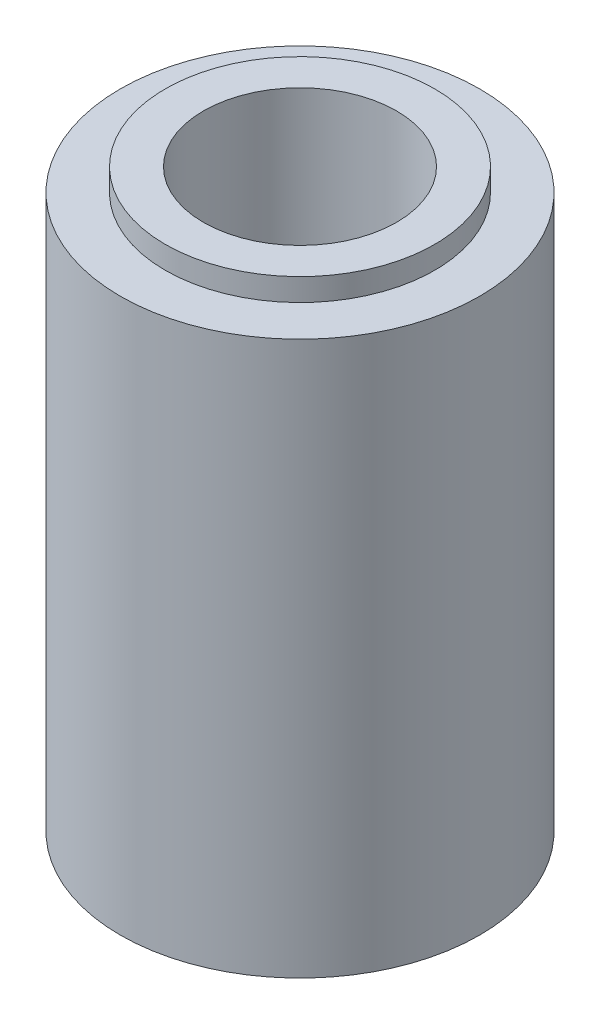
ISO-10303-21;
HEADER;
FILE_DESCRIPTION(('STEP AP214'),'2;1');
FILE_NAME('part.step','',(''),(''),'','','');
FILE_SCHEMA(('AUTOMOTIVE_DESIGN { 1 0 10303 214 1 1 1 1 }'));
ENDSEC;
DATA;
#1=APPLICATION_CONTEXT('core data for automotive mechanical design processes');
#2=APPLICATION_PROTOCOL_DEFINITION('international standard','automotive_design',2000,#1);
#3=PRODUCT_CONTEXT('',#1,'mechanical');
#4=PRODUCT('Part','Part','',(#3));
#5=PRODUCT_RELATED_PRODUCT_CATEGORY('part','',(#4));
#6=PRODUCT_DEFINITION_FORMATION('','',#4);
#7=PRODUCT_DEFINITION_CONTEXT('part definition',#1,'design');
#8=PRODUCT_DEFINITION('design','',#6,#7);
#9=PRODUCT_DEFINITION_SHAPE('','',#8);
#10=(LENGTH_UNIT() NAMED_UNIT(*) SI_UNIT(.MILLI.,.METRE.));
#11=(NAMED_UNIT(*) PLANE_ANGLE_UNIT() SI_UNIT($,.RADIAN.));
#12=(NAMED_UNIT(*) SI_UNIT($,.STERADIAN.) SOLID_ANGLE_UNIT());
#13=UNCERTAINTY_MEASURE_WITH_UNIT(LENGTH_MEASURE(1.E-05),#10,'distance_accuracy_value','');
#14=(GEOMETRIC_REPRESENTATION_CONTEXT(3) GLOBAL_UNCERTAINTY_ASSIGNED_CONTEXT((#13)) GLOBAL_UNIT_ASSIGNED_CONTEXT((#10,
#11,#12)) REPRESENTATION_CONTEXT('',''));
#15=CARTESIAN_POINT('',(0.,0.,0.));
#16=DIRECTION('',(0.,0.,1.));
#17=DIRECTION('',(1.,0.,0.));
#18=AXIS2_PLACEMENT_3D('',#15,#16,#17);
#19=CARTESIAN_POINT('',(0.,12.82,0.));
#20=DIRECTION('',(0.,-1.,0.));
#21=DIRECTION('',(0.,0.,-1.));
#22=AXIS2_PLACEMENT_3D('',#19,#20,#21);
#23=CYLINDRICAL_SURFACE('',#22,4.);
#24=CARTESIAN_POINT('',(0.,0.,0.));
#25=DIRECTION('',(0.,1.,0.));
#26=DIRECTION('',(0.,0.,1.));
#27=AXIS2_PLACEMENT_3D('',#24,#25,#26);
#28=CIRCLE('',#27,4.);
#29=CARTESIAN_POINT('',(0.,0.,4.));
#30=VERTEX_POINT('',#29);
#31=EDGE_CURVE('E11',#30,#30,#28,.T.);
#32=ORIENTED_EDGE('',*,*,#31,.T.);
#33=EDGE_LOOP('',(#32));
#34=FACE_BOUND('',#33,.T.);
#35=CARTESIAN_POINT('',(0.,12.32,0.));
#36=DIRECTION('',(0.,1.,0.));
#37=DIRECTION('',(0.,0.,1.));
#38=AXIS2_PLACEMENT_3D('',#35,#36,#37);
#39=CIRCLE('',#38,4.);
#40=CARTESIAN_POINT('',(0.,12.32,4.));
#41=VERTEX_POINT('',#40);
#42=EDGE_CURVE('E35',#41,#41,#39,.T.);
#43=ORIENTED_EDGE('',*,*,#42,.F.);
#44=EDGE_LOOP('',(#43));
#45=FACE_BOUND('',#44,.T.);
#46=ADVANCED_FACE('F32',(#34,#45),#23,.T.);
#47=CARTESIAN_POINT('',(0.,0.,0.));
#48=DIRECTION('',(0.,1.,0.));
#49=DIRECTION('',(0.,0.,1.));
#50=AXIS2_PLACEMENT_3D('',#47,#48,#49);
#51=PLANE('',#50);
#52=CARTESIAN_POINT('',(0.,0.,0.));
#53=DIRECTION('',(0.,1.,0.));
#54=DIRECTION('',(0.,0.,1.));
#55=AXIS2_PLACEMENT_3D('',#52,#53,#54);
#56=CIRCLE('',#55,2.15);
#57=CARTESIAN_POINT('',(0.,0.,2.15));
#58=VERTEX_POINT('',#57);
#59=EDGE_CURVE('E47',#58,#58,#56,.T.);
#60=ORIENTED_EDGE('',*,*,#59,.T.);
#61=EDGE_LOOP('',(#60));
#62=FACE_BOUND('',#61,.T.);
#63=ORIENTED_EDGE('',*,*,#31,.F.);
#64=EDGE_LOOP('',(#63));
#65=FACE_BOUND('',#64,.T.);
#66=ADVANCED_FACE('F72',(#62,#65),#51,.F.);
#67=CARTESIAN_POINT('',(0.,12.32,0.));
#68=DIRECTION('',(0.,1.,0.));
#69=DIRECTION('',(0.,0.,1.));
#70=AXIS2_PLACEMENT_3D('',#67,#68,#69);
#71=PLANE('',#70);
#72=CARTESIAN_POINT('',(0.,12.32,0.));
#73=DIRECTION('',(0.,1.,0.));
#74=DIRECTION('',(0.,0.,1.));
#75=AXIS2_PLACEMENT_3D('',#72,#73,#74);
#76=CIRCLE('',#75,3.);
#77=CARTESIAN_POINT('',(0.,12.32,3.));
#78=VERTEX_POINT('',#77);
#79=EDGE_CURVE('E42',#78,#78,#76,.T.);
#80=ORIENTED_EDGE('',*,*,#79,.F.);
#81=EDGE_LOOP('',(#80));
#82=FACE_BOUND('',#81,.T.);
#83=ORIENTED_EDGE('',*,*,#42,.T.);
#84=EDGE_LOOP('',(#83));
#85=FACE_BOUND('',#84,.T.);
#86=ADVANCED_FACE('F66',(#82,#85),#71,.T.);
#87=CARTESIAN_POINT('',(0.,12.32,0.));
#88=DIRECTION('',(0.,1.,0.));
#89=DIRECTION('',(0.,0.,1.));
#90=AXIS2_PLACEMENT_3D('',#87,#88,#89);
#91=CYLINDRICAL_SURFACE('',#90,3.);
#92=ORIENTED_EDGE('',*,*,#79,.T.);
#93=EDGE_LOOP('',(#92));
#94=FACE_BOUND('',#93,.T.);
#95=CARTESIAN_POINT('',(0.,12.82,0.));
#96=DIRECTION('',(0.,1.,0.));
#97=DIRECTION('',(0.,0.,1.));
#98=AXIS2_PLACEMENT_3D('',#95,#96,#97);
#99=CIRCLE('',#98,3.);
#100=CARTESIAN_POINT('',(0.,12.82,3.));
#101=VERTEX_POINT('',#100);
#102=EDGE_CURVE('E44',#101,#101,#99,.T.);
#103=ORIENTED_EDGE('',*,*,#102,.F.);
#104=EDGE_LOOP('',(#103));
#105=FACE_BOUND('',#104,.T.);
#106=ADVANCED_FACE('F61',(#94,#105),#91,.T.);
#107=CARTESIAN_POINT('',(0.,12.82,0.));
#108=DIRECTION('',(0.,1.,0.));
#109=DIRECTION('',(0.,0.,1.));
#110=AXIS2_PLACEMENT_3D('',#107,#108,#109);
#111=PLANE('',#110);
#112=CARTESIAN_POINT('',(0.,12.82,0.));
#113=DIRECTION('',(0.,1.,0.));
#114=DIRECTION('',(0.,0.,1.));
#115=AXIS2_PLACEMENT_3D('',#112,#113,#114);
#116=CIRCLE('',#115,2.15);
#117=CARTESIAN_POINT('',(0.,12.82,2.15));
#118=VERTEX_POINT('',#117);
#119=EDGE_CURVE('E52',#118,#118,#116,.T.);
#120=ORIENTED_EDGE('',*,*,#119,.F.);
#121=EDGE_LOOP('',(#120));
#122=FACE_BOUND('',#121,.T.);
#123=ORIENTED_EDGE('',*,*,#102,.T.);
#124=EDGE_LOOP('',(#123));
#125=FACE_BOUND('',#124,.T.);
#126=ADVANCED_FACE('F58',(#122,#125),#111,.T.);
#127=CARTESIAN_POINT('',(0.,12.82,0.));
#128=DIRECTION('',(0.,1.,0.));
#129=DIRECTION('',(0.,0.,1.));
#130=AXIS2_PLACEMENT_3D('',#127,#128,#129);
#131=CYLINDRICAL_SURFACE('',#130,2.15);
#132=ORIENTED_EDGE('',*,*,#59,.F.);
#133=EDGE_LOOP('',(#132));
#134=FACE_BOUND('',#133,.T.);
#135=ORIENTED_EDGE('',*,*,#119,.T.);
#136=EDGE_LOOP('',(#135));
#137=FACE_BOUND('',#136,.T.);
#138=ADVANCED_FACE('F56',(#134,#137),#131,.F.);
#139=CLOSED_SHELL('',(#46,#66,#86,#106,#126,#138));
#140=MANIFOLD_SOLID_BREP('B2',#139);
#141=ADVANCED_BREP_SHAPE_REPRESENTATION('',(#18,#140),#14);
#142=SHAPE_DEFINITION_REPRESENTATION(#9,#141);
ENDSEC;
END-ISO-10303-21;
